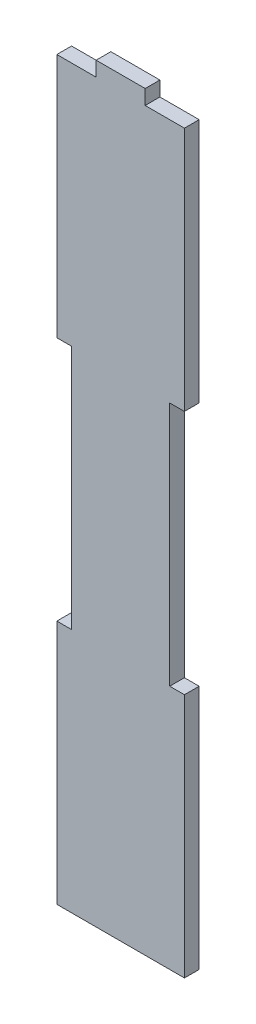
ISO-10303-21;
HEADER;
FILE_DESCRIPTION(('STEP AP214'),'2;1');
FILE_NAME('part.step','',(''),(''),'','','');
FILE_SCHEMA(('AUTOMOTIVE_DESIGN { 1 0 10303 214 1 1 1 1 }'));
ENDSEC;
DATA;
#1=APPLICATION_CONTEXT('core data for automotive mechanical design processes');
#2=APPLICATION_PROTOCOL_DEFINITION('international standard','automotive_design',2000,#1);
#3=PRODUCT_CONTEXT('',#1,'mechanical');
#4=PRODUCT('Part','Part','',(#3));
#5=PRODUCT_RELATED_PRODUCT_CATEGORY('part','',(#4));
#6=PRODUCT_DEFINITION_FORMATION('','',#4);
#7=PRODUCT_DEFINITION_CONTEXT('part definition',#1,'design');
#8=PRODUCT_DEFINITION('design','',#6,#7);
#9=PRODUCT_DEFINITION_SHAPE('','',#8);
#10=(LENGTH_UNIT() NAMED_UNIT(*) SI_UNIT(.MILLI.,.METRE.));
#11=(NAMED_UNIT(*) PLANE_ANGLE_UNIT() SI_UNIT($,.RADIAN.));
#12=(NAMED_UNIT(*) SI_UNIT($,.STERADIAN.) SOLID_ANGLE_UNIT());
#13=UNCERTAINTY_MEASURE_WITH_UNIT(LENGTH_MEASURE(1.E-05),#10,'distance_accuracy_value','');
#14=(GEOMETRIC_REPRESENTATION_CONTEXT(3) GLOBAL_UNCERTAINTY_ASSIGNED_CONTEXT((#13)) GLOBAL_UNIT_ASSIGNED_CONTEXT((#10,
#11,#12)) REPRESENTATION_CONTEXT('',''));
#15=CARTESIAN_POINT('',(0.,0.,0.));
#16=DIRECTION('',(0.,0.,1.));
#17=DIRECTION('',(1.,0.,0.));
#18=AXIS2_PLACEMENT_3D('',#15,#16,#17);
#19=CARTESIAN_POINT('',(0.,0.,3.));
#20=DIRECTION('',(1.,0.,0.));
#21=DIRECTION('',(0.,0.,-1.));
#22=AXIS2_PLACEMENT_3D('',#19,#20,#21);
#23=PLANE('',#22);
#24=DIRECTION('',(0.,-1.,0.));
#25=VECTOR('',#24,1.);
#26=CARTESIAN_POINT('',(0.,0.,0.));
#27=LINE('',#26,#25);
#28=CARTESIAN_POINT('',(0.,50.,0.));
#29=VERTEX_POINT('',#28);
#30=CARTESIAN_POINT('',(0.,0.,0.));
#31=VERTEX_POINT('',#30);
#32=EDGE_CURVE('E179',#29,#31,#27,.T.);
#33=ORIENTED_EDGE('',*,*,#32,.T.);
#34=DIRECTION('',(0.,0.,-1.));
#35=VECTOR('',#34,1.);
#36=CARTESIAN_POINT('',(0.,0.,3.));
#37=LINE('',#36,#35);
#38=CARTESIAN_POINT('',(0.,0.,3.));
#39=VERTEX_POINT('',#38);
#40=EDGE_CURVE('E11',#39,#31,#37,.T.);
#41=ORIENTED_EDGE('',*,*,#40,.F.);
#42=DIRECTION('',(0.,-1.,0.));
#43=VECTOR('',#42,1.);
#44=CARTESIAN_POINT('',(0.,0.,3.));
#45=LINE('',#44,#43);
#46=CARTESIAN_POINT('',(0.,50.,3.));
#47=VERTEX_POINT('',#46);
#48=EDGE_CURVE('E209',#47,#39,#45,.T.);
#49=ORIENTED_EDGE('',*,*,#48,.F.);
#50=DIRECTION('',(0.,0.,-1.));
#51=VECTOR('',#50,1.);
#52=CARTESIAN_POINT('',(0.,50.,3.));
#53=LINE('',#52,#51);
#54=EDGE_CURVE('E175',#47,#29,#53,.T.);
#55=ORIENTED_EDGE('',*,*,#54,.T.);
#56=EDGE_LOOP('',(#33,#41,#49,#55));
#57=FACE_BOUND('',#56,.T.);
#58=ADVANCED_FACE('F35',(#57),#23,.F.);
#59=CARTESIAN_POINT('',(0.,0.,3.));
#60=DIRECTION('',(0.,1.,0.));
#61=DIRECTION('',(0.,0.,1.));
#62=AXIS2_PLACEMENT_3D('',#59,#60,#61);
#63=PLANE('',#62);
#64=DIRECTION('',(1.,0.,0.));
#65=VECTOR('',#64,1.);
#66=CARTESIAN_POINT('',(0.,0.,0.));
#67=LINE('',#66,#65);
#68=CARTESIAN_POINT('',(26.,0.,0.));
#69=VERTEX_POINT('',#68);
#70=EDGE_CURVE('E182',#31,#69,#67,.T.);
#71=ORIENTED_EDGE('',*,*,#70,.T.);
#72=DIRECTION('',(0.,0.,-1.));
#73=VECTOR('',#72,1.);
#74=CARTESIAN_POINT('',(26.,0.,3.));
#75=LINE('',#74,#73);
#76=CARTESIAN_POINT('',(26.,0.,3.));
#77=VERTEX_POINT('',#76);
#78=EDGE_CURVE('E43',#77,#69,#75,.T.);
#79=ORIENTED_EDGE('',*,*,#78,.F.);
#80=DIRECTION('',(1.,0.,0.));
#81=VECTOR('',#80,1.);
#82=CARTESIAN_POINT('',(0.,0.,3.));
#83=LINE('',#82,#81);
#84=EDGE_CURVE('E118',#39,#77,#83,.T.);
#85=ORIENTED_EDGE('',*,*,#84,.F.);
#86=ORIENTED_EDGE('',*,*,#40,.T.);
#87=EDGE_LOOP('',(#71,#79,#85,#86));
#88=FACE_BOUND('',#87,.T.);
#89=ADVANCED_FACE('F307',(#88),#63,.F.);
#90=CARTESIAN_POINT('',(26.,0.,3.));
#91=DIRECTION('',(-1.,0.,0.));
#92=DIRECTION('',(0.,0.,1.));
#93=AXIS2_PLACEMENT_3D('',#90,#91,#92);
#94=PLANE('',#93);
#95=DIRECTION('',(0.,1.,0.));
#96=VECTOR('',#95,1.);
#97=CARTESIAN_POINT('',(26.,0.,0.));
#98=LINE('',#97,#96);
#99=CARTESIAN_POINT('',(26.,50.,0.));
#100=VERTEX_POINT('',#99);
#101=EDGE_CURVE('E184',#69,#100,#98,.T.);
#102=ORIENTED_EDGE('',*,*,#101,.T.);
#103=DIRECTION('',(0.,0.,-1.));
#104=VECTOR('',#103,1.);
#105=CARTESIAN_POINT('',(26.,50.,3.));
#106=LINE('',#105,#104);
#107=CARTESIAN_POINT('',(26.,50.,3.));
#108=VERTEX_POINT('',#107);
#109=EDGE_CURVE('E240',#108,#100,#106,.T.);
#110=ORIENTED_EDGE('',*,*,#109,.F.);
#111=DIRECTION('',(0.,1.,0.));
#112=VECTOR('',#111,1.);
#113=CARTESIAN_POINT('',(26.,0.,3.));
#114=LINE('',#113,#112);
#115=EDGE_CURVE('E248',#77,#108,#114,.T.);
#116=ORIENTED_EDGE('',*,*,#115,.F.);
#117=ORIENTED_EDGE('',*,*,#78,.T.);
#118=EDGE_LOOP('',(#102,#110,#116,#117));
#119=FACE_BOUND('',#118,.T.);
#120=ADVANCED_FACE('F246',(#119),#94,.F.);
#121=CARTESIAN_POINT('',(26.,50.,3.));
#122=DIRECTION('',(0.,-1.,0.));
#123=DIRECTION('',(0.,0.,-1.));
#124=AXIS2_PLACEMENT_3D('',#121,#122,#123);
#125=PLANE('',#124);
#126=DIRECTION('',(-1.,0.,0.));
#127=VECTOR('',#126,1.);
#128=CARTESIAN_POINT('',(26.,50.,0.));
#129=LINE('',#128,#127);
#130=CARTESIAN_POINT('',(23.,50.,0.));
#131=VERTEX_POINT('',#130);
#132=EDGE_CURVE('E186',#100,#131,#129,.T.);
#133=ORIENTED_EDGE('',*,*,#132,.T.);
#134=DIRECTION('',(0.,0.,-1.));
#135=VECTOR('',#134,1.);
#136=CARTESIAN_POINT('',(23.,50.,3.));
#137=LINE('',#136,#135);
#138=CARTESIAN_POINT('',(23.,50.,3.));
#139=VERTEX_POINT('',#138);
#140=EDGE_CURVE('E237',#139,#131,#137,.T.);
#141=ORIENTED_EDGE('',*,*,#140,.F.);
#142=DIRECTION('',(-1.,0.,0.));
#143=VECTOR('',#142,1.);
#144=CARTESIAN_POINT('',(26.,50.,3.));
#145=LINE('',#144,#143);
#146=EDGE_CURVE('E266',#108,#139,#145,.T.);
#147=ORIENTED_EDGE('',*,*,#146,.F.);
#148=ORIENTED_EDGE('',*,*,#109,.T.);
#149=EDGE_LOOP('',(#133,#141,#147,#148));
#150=FACE_BOUND('',#149,.T.);
#151=ADVANCED_FACE('F257',(#150),#125,.F.);
#152=CARTESIAN_POINT('',(23.,100.,3.));
#153=DIRECTION('',(-1.,0.,0.));
#154=DIRECTION('',(0.,0.,1.));
#155=AXIS2_PLACEMENT_3D('',#152,#153,#154);
#156=PLANE('',#155);
#157=DIRECTION('',(0.,1.,0.));
#158=VECTOR('',#157,1.);
#159=CARTESIAN_POINT('',(23.,100.,0.));
#160=LINE('',#159,#158);
#161=CARTESIAN_POINT('',(23.,100.,0.));
#162=VERTEX_POINT('',#161);
#163=EDGE_CURVE('E188',#131,#162,#160,.T.);
#164=ORIENTED_EDGE('',*,*,#163,.T.);
#165=DIRECTION('',(0.,0.,-1.));
#166=VECTOR('',#165,1.);
#167=CARTESIAN_POINT('',(23.,100.,3.));
#168=LINE('',#167,#166);
#169=CARTESIAN_POINT('',(23.,100.,3.));
#170=VERTEX_POINT('',#169);
#171=EDGE_CURVE('E234',#170,#162,#168,.T.);
#172=ORIENTED_EDGE('',*,*,#171,.F.);
#173=DIRECTION('',(0.,1.,0.));
#174=VECTOR('',#173,1.);
#175=CARTESIAN_POINT('',(23.,100.,3.));
#176=LINE('',#175,#174);
#177=EDGE_CURVE('E263',#139,#170,#176,.T.);
#178=ORIENTED_EDGE('',*,*,#177,.F.);
#179=ORIENTED_EDGE('',*,*,#140,.T.);
#180=EDGE_LOOP('',(#164,#172,#178,#179));
#181=FACE_BOUND('',#180,.T.);
#182=ADVANCED_FACE('F261',(#181),#156,.F.);
#183=CARTESIAN_POINT('',(26.,100.,3.));
#184=DIRECTION('',(0.,1.,0.));
#185=DIRECTION('',(-1.,0.,0.));
#186=AXIS2_PLACEMENT_3D('',#183,#184,#185);
#187=PLANE('',#186);
#188=DIRECTION('',(1.,0.,0.));
#189=VECTOR('',#188,1.);
#190=CARTESIAN_POINT('',(26.,100.,0.));
#191=LINE('',#190,#189);
#192=CARTESIAN_POINT('',(26.,100.,0.));
#193=VERTEX_POINT('',#192);
#194=EDGE_CURVE('E190',#162,#193,#191,.T.);
#195=ORIENTED_EDGE('',*,*,#194,.T.);
#196=DIRECTION('',(0.,0.,-1.));
#197=VECTOR('',#196,1.);
#198=CARTESIAN_POINT('',(26.,100.,3.));
#199=LINE('',#198,#197);
#200=CARTESIAN_POINT('',(26.,100.,3.));
#201=VERTEX_POINT('',#200);
#202=EDGE_CURVE('E231',#201,#193,#199,.T.);
#203=ORIENTED_EDGE('',*,*,#202,.F.);
#204=DIRECTION('',(1.,0.,0.));
#205=VECTOR('',#204,1.);
#206=CARTESIAN_POINT('',(26.,100.,3.));
#207=LINE('',#206,#205);
#208=EDGE_CURVE('E265',#170,#201,#207,.T.);
#209=ORIENTED_EDGE('',*,*,#208,.F.);
#210=ORIENTED_EDGE('',*,*,#171,.T.);
#211=EDGE_LOOP('',(#195,#203,#209,#210));
#212=FACE_BOUND('',#211,.T.);
#213=ADVANCED_FACE('F320',(#212),#187,.F.);
#214=CARTESIAN_POINT('',(26.,100.,3.));
#215=DIRECTION('',(-1.,0.,0.));
#216=DIRECTION('',(0.,0.,1.));
#217=AXIS2_PLACEMENT_3D('',#214,#215,#216);
#218=PLANE('',#217);
#219=DIRECTION('',(0.,1.,0.));
#220=VECTOR('',#219,1.);
#221=CARTESIAN_POINT('',(26.,100.,0.));
#222=LINE('',#221,#220);
#223=CARTESIAN_POINT('',(26.,150.,0.));
#224=VERTEX_POINT('',#223);
#225=EDGE_CURVE('E192',#193,#224,#222,.T.);
#226=ORIENTED_EDGE('',*,*,#225,.T.);
#227=DIRECTION('',(0.,0.,-1.));
#228=VECTOR('',#227,1.);
#229=CARTESIAN_POINT('',(26.,150.,3.));
#230=LINE('',#229,#228);
#231=CARTESIAN_POINT('',(26.,150.,3.));
#232=VERTEX_POINT('',#231);
#233=EDGE_CURVE('E228',#232,#224,#230,.T.);
#234=ORIENTED_EDGE('',*,*,#233,.F.);
#235=DIRECTION('',(0.,1.,0.));
#236=VECTOR('',#235,1.);
#237=CARTESIAN_POINT('',(26.,100.,3.));
#238=LINE('',#237,#236);
#239=EDGE_CURVE('E268',#201,#232,#238,.T.);
#240=ORIENTED_EDGE('',*,*,#239,.F.);
#241=ORIENTED_EDGE('',*,*,#202,.T.);
#242=EDGE_LOOP('',(#226,#234,#240,#241));
#243=FACE_BOUND('',#242,.T.);
#244=ADVANCED_FACE('F323',(#243),#218,.F.);
#245=CARTESIAN_POINT('',(18.,150.,3.));
#246=DIRECTION('',(0.,-1.,0.));
#247=DIRECTION('',(0.,0.,-1.));
#248=AXIS2_PLACEMENT_3D('',#245,#246,#247);
#249=PLANE('',#248);
#250=DIRECTION('',(-1.,0.,0.));
#251=VECTOR('',#250,1.);
#252=CARTESIAN_POINT('',(18.,150.,0.));
#253=LINE('',#252,#251);
#254=CARTESIAN_POINT('',(18.,150.,0.));
#255=VERTEX_POINT('',#254);
#256=EDGE_CURVE('E194',#224,#255,#253,.T.);
#257=ORIENTED_EDGE('',*,*,#256,.T.);
#258=DIRECTION('',(0.,0.,-1.));
#259=VECTOR('',#258,1.);
#260=CARTESIAN_POINT('',(18.,150.,3.));
#261=LINE('',#260,#259);
#262=CARTESIAN_POINT('',(18.,150.,3.));
#263=VERTEX_POINT('',#262);
#264=EDGE_CURVE('E225',#263,#255,#261,.T.);
#265=ORIENTED_EDGE('',*,*,#264,.F.);
#266=DIRECTION('',(-1.,0.,0.));
#267=VECTOR('',#266,1.);
#268=CARTESIAN_POINT('',(18.,150.,3.));
#269=LINE('',#268,#267);
#270=EDGE_CURVE('E274',#232,#263,#269,.T.);
#271=ORIENTED_EDGE('',*,*,#270,.F.);
#272=ORIENTED_EDGE('',*,*,#233,.T.);
#273=EDGE_LOOP('',(#257,#265,#271,#272));
#274=FACE_BOUND('',#273,.T.);
#275=ADVANCED_FACE('F327',(#274),#249,.F.);
#276=CARTESIAN_POINT('',(18.,150.,3.));
#277=DIRECTION('',(-1.,0.,0.));
#278=DIRECTION('',(0.,0.,1.));
#279=AXIS2_PLACEMENT_3D('',#276,#277,#278);
#280=PLANE('',#279);
#281=DIRECTION('',(0.,1.,0.));
#282=VECTOR('',#281,1.);
#283=CARTESIAN_POINT('',(18.,150.,0.));
#284=LINE('',#283,#282);
#285=CARTESIAN_POINT('',(18.,153.,0.));
#286=VERTEX_POINT('',#285);
#287=EDGE_CURVE('E196',#255,#286,#284,.T.);
#288=ORIENTED_EDGE('',*,*,#287,.T.);
#289=DIRECTION('',(0.,0.,-1.));
#290=VECTOR('',#289,1.);
#291=CARTESIAN_POINT('',(18.,153.,3.));
#292=LINE('',#291,#290);
#293=CARTESIAN_POINT('',(18.,153.,3.));
#294=VERTEX_POINT('',#293);
#295=EDGE_CURVE('E222',#294,#286,#292,.T.);
#296=ORIENTED_EDGE('',*,*,#295,.F.);
#297=DIRECTION('',(0.,1.,0.));
#298=VECTOR('',#297,1.);
#299=CARTESIAN_POINT('',(18.,150.,3.));
#300=LINE('',#299,#298);
#301=EDGE_CURVE('E276',#263,#294,#300,.T.);
#302=ORIENTED_EDGE('',*,*,#301,.F.);
#303=ORIENTED_EDGE('',*,*,#264,.T.);
#304=EDGE_LOOP('',(#288,#296,#302,#303));
#305=FACE_BOUND('',#304,.T.);
#306=ADVANCED_FACE('F331',(#305),#280,.F.);
#307=CARTESIAN_POINT('',(8.,153.,3.));
#308=DIRECTION('',(0.,-1.,0.));
#309=DIRECTION('',(0.,0.,-1.));
#310=AXIS2_PLACEMENT_3D('',#307,#308,#309);
#311=PLANE('',#310);
#312=DIRECTION('',(-1.,0.,0.));
#313=VECTOR('',#312,1.);
#314=CARTESIAN_POINT('',(8.,153.,0.));
#315=LINE('',#314,#313);
#316=CARTESIAN_POINT('',(8.,153.,0.));
#317=VERTEX_POINT('',#316);
#318=EDGE_CURVE('E198',#286,#317,#315,.T.);
#319=ORIENTED_EDGE('',*,*,#318,.T.);
#320=DIRECTION('',(0.,0.,-1.));
#321=VECTOR('',#320,1.);
#322=CARTESIAN_POINT('',(8.,153.,3.));
#323=LINE('',#322,#321);
#324=CARTESIAN_POINT('',(8.,153.,3.));
#325=VERTEX_POINT('',#324);
#326=EDGE_CURVE('E219',#325,#317,#323,.T.);
#327=ORIENTED_EDGE('',*,*,#326,.F.);
#328=DIRECTION('',(-1.,0.,0.));
#329=VECTOR('',#328,1.);
#330=CARTESIAN_POINT('',(8.,153.,3.));
#331=LINE('',#330,#329);
#332=EDGE_CURVE('E278',#294,#325,#331,.T.);
#333=ORIENTED_EDGE('',*,*,#332,.F.);
#334=ORIENTED_EDGE('',*,*,#295,.T.);
#335=EDGE_LOOP('',(#319,#327,#333,#334));
#336=FACE_BOUND('',#335,.T.);
#337=ADVANCED_FACE('F335',(#336),#311,.F.);
#338=CARTESIAN_POINT('',(8.,150.,3.));
#339=DIRECTION('',(1.,0.,0.));
#340=DIRECTION('',(0.,0.,-1.));
#341=AXIS2_PLACEMENT_3D('',#338,#339,#340);
#342=PLANE('',#341);
#343=DIRECTION('',(0.,-1.,0.));
#344=VECTOR('',#343,1.);
#345=CARTESIAN_POINT('',(8.,150.,0.));
#346=LINE('',#345,#344);
#347=CARTESIAN_POINT('',(8.,150.,0.));
#348=VERTEX_POINT('',#347);
#349=EDGE_CURVE('E200',#317,#348,#346,.T.);
#350=ORIENTED_EDGE('',*,*,#349,.T.);
#351=DIRECTION('',(0.,0.,-1.));
#352=VECTOR('',#351,1.);
#353=CARTESIAN_POINT('',(8.,150.,3.));
#354=LINE('',#353,#352);
#355=CARTESIAN_POINT('',(8.,150.,3.));
#356=VERTEX_POINT('',#355);
#357=EDGE_CURVE('E216',#356,#348,#354,.T.);
#358=ORIENTED_EDGE('',*,*,#357,.F.);
#359=DIRECTION('',(0.,-1.,0.));
#360=VECTOR('',#359,1.);
#361=CARTESIAN_POINT('',(8.,150.,3.));
#362=LINE('',#361,#360);
#363=EDGE_CURVE('E280',#325,#356,#362,.T.);
#364=ORIENTED_EDGE('',*,*,#363,.F.);
#365=ORIENTED_EDGE('',*,*,#326,.T.);
#366=EDGE_LOOP('',(#350,#358,#364,#365));
#367=FACE_BOUND('',#366,.T.);
#368=ADVANCED_FACE('F339',(#367),#342,.F.);
#369=CARTESIAN_POINT('',(0.,150.,3.));
#370=DIRECTION('',(0.,-1.,0.));
#371=DIRECTION('',(1.,0.,0.));
#372=AXIS2_PLACEMENT_3D('',#369,#370,#371);
#373=PLANE('',#372);
#374=DIRECTION('',(-1.,0.,0.));
#375=VECTOR('',#374,1.);
#376=CARTESIAN_POINT('',(0.,150.,0.));
#377=LINE('',#376,#375);
#378=CARTESIAN_POINT('',(0.,150.,0.));
#379=VERTEX_POINT('',#378);
#380=EDGE_CURVE('E202',#348,#379,#377,.T.);
#381=ORIENTED_EDGE('',*,*,#380,.T.);
#382=DIRECTION('',(0.,0.,-1.));
#383=VECTOR('',#382,1.);
#384=CARTESIAN_POINT('',(0.,150.,3.));
#385=LINE('',#384,#383);
#386=CARTESIAN_POINT('',(0.,150.,3.));
#387=VERTEX_POINT('',#386);
#388=EDGE_CURVE('E213',#387,#379,#385,.T.);
#389=ORIENTED_EDGE('',*,*,#388,.F.);
#390=DIRECTION('',(-1.,0.,0.));
#391=VECTOR('',#390,1.);
#392=CARTESIAN_POINT('',(0.,150.,3.));
#393=LINE('',#392,#391);
#394=EDGE_CURVE('E282',#356,#387,#393,.T.);
#395=ORIENTED_EDGE('',*,*,#394,.F.);
#396=ORIENTED_EDGE('',*,*,#357,.T.);
#397=EDGE_LOOP('',(#381,#389,#395,#396));
#398=FACE_BOUND('',#397,.T.);
#399=ADVANCED_FACE('F288',(#398),#373,.F.);
#400=CARTESIAN_POINT('',(0.,100.,3.));
#401=DIRECTION('',(1.,0.,0.));
#402=DIRECTION('',(0.,0.,-1.));
#403=AXIS2_PLACEMENT_3D('',#400,#401,#402);
#404=PLANE('',#403);
#405=DIRECTION('',(0.,-1.,0.));
#406=VECTOR('',#405,1.);
#407=CARTESIAN_POINT('',(0.,100.,0.));
#408=LINE('',#407,#406);
#409=CARTESIAN_POINT('',(0.,100.,0.));
#410=VERTEX_POINT('',#409);
#411=EDGE_CURVE('E204',#379,#410,#408,.T.);
#412=ORIENTED_EDGE('',*,*,#411,.T.);
#413=DIRECTION('',(0.,0.,-1.));
#414=VECTOR('',#413,1.);
#415=CARTESIAN_POINT('',(0.,100.,3.));
#416=LINE('',#415,#414);
#417=CARTESIAN_POINT('',(0.,100.,3.));
#418=VERTEX_POINT('',#417);
#419=EDGE_CURVE('E170',#418,#410,#416,.T.);
#420=ORIENTED_EDGE('',*,*,#419,.F.);
#421=DIRECTION('',(0.,-1.,0.));
#422=VECTOR('',#421,1.);
#423=CARTESIAN_POINT('',(0.,100.,3.));
#424=LINE('',#423,#422);
#425=EDGE_CURVE('E161',#387,#418,#424,.T.);
#426=ORIENTED_EDGE('',*,*,#425,.F.);
#427=ORIENTED_EDGE('',*,*,#388,.T.);
#428=EDGE_LOOP('',(#412,#420,#426,#427));
#429=FACE_BOUND('',#428,.T.);
#430=ADVANCED_FACE('F292',(#429),#404,.F.);
#431=CARTESIAN_POINT('',(0.,100.,3.));
#432=DIRECTION('',(0.,1.,0.));
#433=DIRECTION('',(0.,0.,1.));
#434=AXIS2_PLACEMENT_3D('',#431,#432,#433);
#435=PLANE('',#434);
#436=DIRECTION('',(1.,0.,0.));
#437=VECTOR('',#436,1.);
#438=CARTESIAN_POINT('',(0.,100.,0.));
#439=LINE('',#438,#437);
#440=CARTESIAN_POINT('',(3.,100.,0.));
#441=VERTEX_POINT('',#440);
#442=EDGE_CURVE('E169',#410,#441,#439,.T.);
#443=ORIENTED_EDGE('',*,*,#442,.T.);
#444=DIRECTION('',(0.,0.,-1.));
#445=VECTOR('',#444,1.);
#446=CARTESIAN_POINT('',(3.,100.,3.));
#447=LINE('',#446,#445);
#448=CARTESIAN_POINT('',(3.,100.,3.));
#449=VERTEX_POINT('',#448);
#450=EDGE_CURVE('E166',#449,#441,#447,.T.);
#451=ORIENTED_EDGE('',*,*,#450,.F.);
#452=DIRECTION('',(1.,0.,0.));
#453=VECTOR('',#452,1.);
#454=CARTESIAN_POINT('',(0.,100.,3.));
#455=LINE('',#454,#453);
#456=EDGE_CURVE('E155',#418,#449,#455,.T.);
#457=ORIENTED_EDGE('',*,*,#456,.F.);
#458=ORIENTED_EDGE('',*,*,#419,.T.);
#459=EDGE_LOOP('',(#443,#451,#457,#458));
#460=FACE_BOUND('',#459,.T.);
#461=ADVANCED_FACE('F167',(#460),#435,.F.);
#462=CARTESIAN_POINT('',(3.,100.,3.));
#463=DIRECTION('',(1.,0.,0.));
#464=DIRECTION('',(0.,0.,-1.));
#465=AXIS2_PLACEMENT_3D('',#462,#463,#464);
#466=PLANE('',#465);
#467=DIRECTION('',(0.,-1.,0.));
#468=VECTOR('',#467,1.);
#469=CARTESIAN_POINT('',(3.,100.,0.));
#470=LINE('',#469,#468);
#471=CARTESIAN_POINT('',(3.,50.,0.));
#472=VERTEX_POINT('',#471);
#473=EDGE_CURVE('E104',#441,#472,#470,.T.);
#474=ORIENTED_EDGE('',*,*,#473,.T.);
#475=DIRECTION('',(0.,0.,-1.));
#476=VECTOR('',#475,1.);
#477=CARTESIAN_POINT('',(3.,50.,3.));
#478=LINE('',#477,#476);
#479=CARTESIAN_POINT('',(3.,50.,3.));
#480=VERTEX_POINT('',#479);
#481=EDGE_CURVE('E171',#480,#472,#478,.T.);
#482=ORIENTED_EDGE('',*,*,#481,.F.);
#483=DIRECTION('',(0.,-1.,0.));
#484=VECTOR('',#483,1.);
#485=CARTESIAN_POINT('',(3.,100.,3.));
#486=LINE('',#485,#484);
#487=EDGE_CURVE('E159',#449,#480,#486,.T.);
#488=ORIENTED_EDGE('',*,*,#487,.F.);
#489=ORIENTED_EDGE('',*,*,#450,.T.);
#490=EDGE_LOOP('',(#474,#482,#488,#489));
#491=FACE_BOUND('',#490,.T.);
#492=ADVANCED_FACE('F173',(#491),#466,.F.);
#493=CARTESIAN_POINT('',(0.,50.,3.));
#494=DIRECTION('',(0.,-1.,0.));
#495=DIRECTION('',(1.,0.,0.));
#496=AXIS2_PLACEMENT_3D('',#493,#494,#495);
#497=PLANE('',#496);
#498=DIRECTION('',(-1.,0.,0.));
#499=VECTOR('',#498,1.);
#500=CARTESIAN_POINT('',(0.,50.,0.));
#501=LINE('',#500,#499);
#502=EDGE_CURVE('E110',#472,#29,#501,.T.);
#503=ORIENTED_EDGE('',*,*,#502,.T.);
#504=ORIENTED_EDGE('',*,*,#54,.F.);
#505=DIRECTION('',(-1.,0.,0.));
#506=VECTOR('',#505,1.);
#507=CARTESIAN_POINT('',(0.,50.,3.));
#508=LINE('',#507,#506);
#509=EDGE_CURVE('E51',#480,#47,#508,.T.);
#510=ORIENTED_EDGE('',*,*,#509,.F.);
#511=ORIENTED_EDGE('',*,*,#481,.T.);
#512=EDGE_LOOP('',(#503,#504,#510,#511));
#513=FACE_BOUND('',#512,.T.);
#514=ADVANCED_FACE('F296',(#513),#497,.F.);
#515=CARTESIAN_POINT('',(0.,0.,3.));
#516=DIRECTION('',(0.,0.,-1.));
#517=DIRECTION('',(-1.,0.,0.));
#518=AXIS2_PLACEMENT_3D('',#515,#516,#517);
#519=PLANE('',#518);
#520=ORIENTED_EDGE('',*,*,#48,.T.);
#521=ORIENTED_EDGE('',*,*,#84,.T.);
#522=ORIENTED_EDGE('',*,*,#115,.T.);
#523=ORIENTED_EDGE('',*,*,#146,.T.);
#524=ORIENTED_EDGE('',*,*,#177,.T.);
#525=ORIENTED_EDGE('',*,*,#208,.T.);
#526=ORIENTED_EDGE('',*,*,#239,.T.);
#527=ORIENTED_EDGE('',*,*,#270,.T.);
#528=ORIENTED_EDGE('',*,*,#301,.T.);
#529=ORIENTED_EDGE('',*,*,#332,.T.);
#530=ORIENTED_EDGE('',*,*,#363,.T.);
#531=ORIENTED_EDGE('',*,*,#394,.T.);
#532=ORIENTED_EDGE('',*,*,#425,.T.);
#533=ORIENTED_EDGE('',*,*,#456,.T.);
#534=ORIENTED_EDGE('',*,*,#487,.T.);
#535=ORIENTED_EDGE('',*,*,#509,.T.);
#536=EDGE_LOOP('',(#520,#521,#522,#523,#524,#525,#526,#527,#528,#529,#530,#531,#532,#533,#534,#535));
#537=FACE_BOUND('',#536,.T.);
#538=ADVANCED_FACE('F157',(#537),#519,.F.);
#539=CARTESIAN_POINT('',(0.,0.,0.));
#540=DIRECTION('',(0.,0.,-1.));
#541=DIRECTION('',(-1.,0.,0.));
#542=AXIS2_PLACEMENT_3D('',#539,#540,#541);
#543=PLANE('',#542);
#544=ORIENTED_EDGE('',*,*,#32,.F.);
#545=ORIENTED_EDGE('',*,*,#502,.F.);
#546=ORIENTED_EDGE('',*,*,#473,.F.);
#547=ORIENTED_EDGE('',*,*,#442,.F.);
#548=ORIENTED_EDGE('',*,*,#411,.F.);
#549=ORIENTED_EDGE('',*,*,#380,.F.);
#550=ORIENTED_EDGE('',*,*,#349,.F.);
#551=ORIENTED_EDGE('',*,*,#318,.F.);
#552=ORIENTED_EDGE('',*,*,#287,.F.);
#553=ORIENTED_EDGE('',*,*,#256,.F.);
#554=ORIENTED_EDGE('',*,*,#225,.F.);
#555=ORIENTED_EDGE('',*,*,#194,.F.);
#556=ORIENTED_EDGE('',*,*,#163,.F.);
#557=ORIENTED_EDGE('',*,*,#132,.F.);
#558=ORIENTED_EDGE('',*,*,#101,.F.);
#559=ORIENTED_EDGE('',*,*,#70,.F.);
#560=EDGE_LOOP('',(#544,#545,#546,#547,#548,#549,#550,#551,#552,#553,#554,#555,#556,#557,#558,#559));
#561=FACE_BOUND('',#560,.T.);
#562=ADVANCED_FACE('F252',(#561),#543,.T.);
#563=CLOSED_SHELL('',(#58,#89,#120,#151,#182,#213,#244,#275,#306,#337,#368,#399,#430,#461,#492,
#514,#538,#562));
#564=MANIFOLD_SOLID_BREP('B2',#563);
#565=ADVANCED_BREP_SHAPE_REPRESENTATION('',(#18,#564),#14);
#566=SHAPE_DEFINITION_REPRESENTATION(#9,#565);
ENDSEC;
END-ISO-10303-21;
